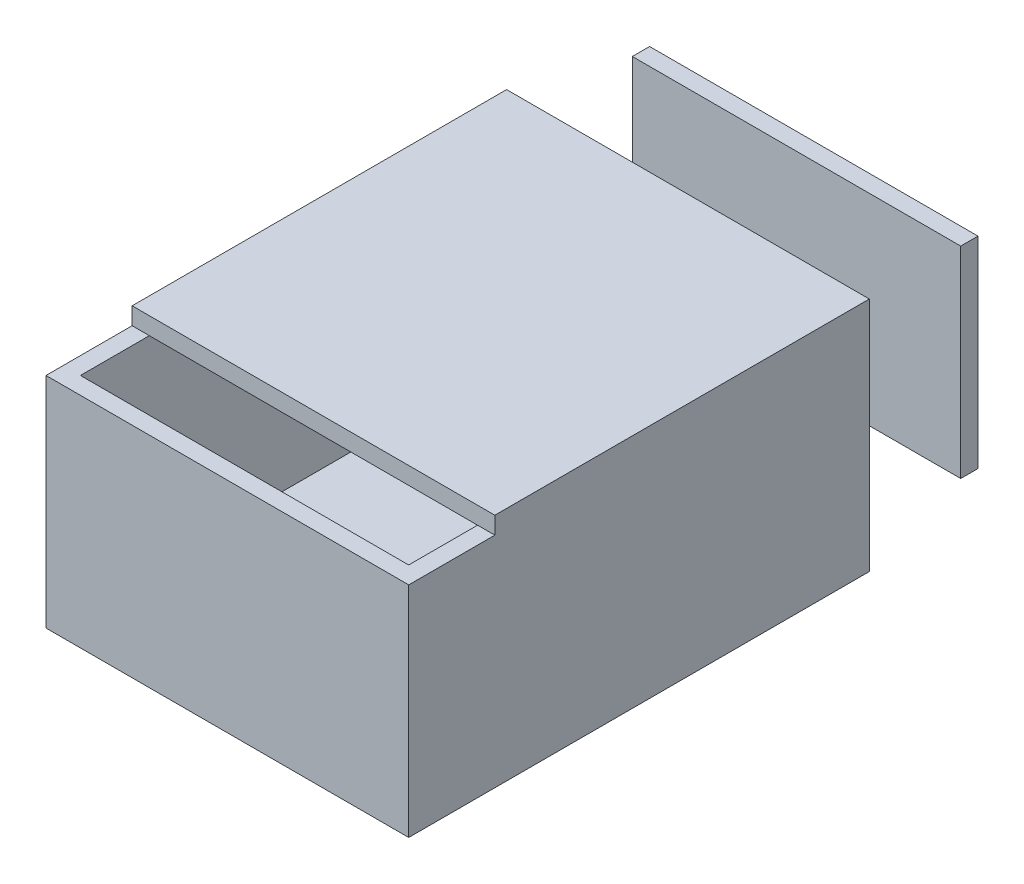
ISO-10303-21;
HEADER;
FILE_DESCRIPTION(('STEP AP214'),'2;1');
FILE_NAME('part.step','',(''),(''),'','','');
FILE_SCHEMA(('AUTOMOTIVE_DESIGN { 1 0 10303 214 1 1 1 1 }'));
ENDSEC;
DATA;
#1=APPLICATION_CONTEXT('core data for automotive mechanical design processes');
#2=APPLICATION_PROTOCOL_DEFINITION('international standard','automotive_design',2000,#1);
#3=PRODUCT_CONTEXT('',#1,'mechanical');
#4=PRODUCT('Part','Part','',(#3));
#5=PRODUCT_RELATED_PRODUCT_CATEGORY('part','',(#4));
#6=PRODUCT_DEFINITION_FORMATION('','',#4);
#7=PRODUCT_DEFINITION_CONTEXT('part definition',#1,'design');
#8=PRODUCT_DEFINITION('design','',#6,#7);
#9=PRODUCT_DEFINITION_SHAPE('','',#8);
#10=(LENGTH_UNIT() NAMED_UNIT(*) SI_UNIT(.MILLI.,.METRE.));
#11=(NAMED_UNIT(*) PLANE_ANGLE_UNIT() SI_UNIT($,.RADIAN.));
#12=(NAMED_UNIT(*) SI_UNIT($,.STERADIAN.) SOLID_ANGLE_UNIT());
#13=UNCERTAINTY_MEASURE_WITH_UNIT(LENGTH_MEASURE(1.E-05),#10,'distance_accuracy_value','');
#14=(GEOMETRIC_REPRESENTATION_CONTEXT(3) GLOBAL_UNCERTAINTY_ASSIGNED_CONTEXT((#13)) GLOBAL_UNIT_ASSIGNED_CONTEXT((#10,
#11,#12)) REPRESENTATION_CONTEXT('',''));
#15=CARTESIAN_POINT('',(0.,0.,0.));
#16=DIRECTION('',(0.,0.,1.));
#17=DIRECTION('',(1.,0.,0.));
#18=AXIS2_PLACEMENT_3D('',#15,#16,#17);
#19=CARTESIAN_POINT('',(1.83640845354915,36.8983163967638,-23.));
#20=DIRECTION('',(0.,-1.,0.));
#21=DIRECTION('',(0.,0.,-1.));
#22=AXIS2_PLACEMENT_3D('',#19,#20,#21);
#23=PLANE('',#22);
#24=DIRECTION('',(1.,0.,0.));
#25=VECTOR('',#24,1.);
#26=CARTESIAN_POINT('',(1.83640845354915,36.8983163967638,-20.));
#27=LINE('',#26,#25);
#28=CARTESIAN_POINT('',(1.83640845354915,36.8983163967638,-20.));
#29=VERTEX_POINT('',#28);
#30=CARTESIAN_POINT('',(58.8750360024886,36.8983163967638,-20.));
#31=VERTEX_POINT('',#30);
#32=EDGE_CURVE('E112',#29,#31,#27,.T.);
#33=ORIENTED_EDGE('',*,*,#32,.T.);
#34=DIRECTION('',(0.,0.,1.));
#35=VECTOR('',#34,1.);
#36=CARTESIAN_POINT('',(58.8750360024886,36.8983163967638,-23.));
#37=LINE('',#36,#35);
#38=CARTESIAN_POINT('',(58.8750360024886,36.8983163967638,-23.));
#39=VERTEX_POINT('',#38);
#40=EDGE_CURVE('E12',#39,#31,#37,.T.);
#41=ORIENTED_EDGE('',*,*,#40,.F.);
#42=DIRECTION('',(1.,0.,0.));
#43=VECTOR('',#42,1.);
#44=CARTESIAN_POINT('',(1.83640845354915,36.8983163967638,-23.));
#45=LINE('',#44,#43);
#46=CARTESIAN_POINT('',(1.83640845354915,36.8983163967638,-23.));
#47=VERTEX_POINT('',#46);
#48=EDGE_CURVE('E100',#47,#39,#45,.T.);
#49=ORIENTED_EDGE('',*,*,#48,.F.);
#50=DIRECTION('',(0.,0.,1.));
#51=VECTOR('',#50,1.);
#52=CARTESIAN_POINT('',(1.83640845354915,36.8983163967638,-23.));
#53=LINE('',#52,#51);
#54=EDGE_CURVE('E108',#47,#29,#53,.T.);
#55=ORIENTED_EDGE('',*,*,#54,.T.);
#56=EDGE_LOOP('',(#33,#41,#49,#55));
#57=FACE_BOUND('',#56,.T.);
#58=ADVANCED_FACE('F49',(#57),#23,.F.);
#59=CARTESIAN_POINT('',(58.8750360024886,36.8983163967638,-23.));
#60=DIRECTION('',(-1.,0.,0.));
#61=DIRECTION('',(0.,0.,1.));
#62=AXIS2_PLACEMENT_3D('',#59,#60,#61);
#63=PLANE('',#62);
#64=DIRECTION('',(0.,-1.,0.));
#65=VECTOR('',#64,1.);
#66=CARTESIAN_POINT('',(58.8750360024886,36.8983163967638,-20.));
#67=LINE('',#66,#65);
#68=CARTESIAN_POINT('',(58.8750360024886,1.9307687903769,-20.));
#69=VERTEX_POINT('',#68);
#70=EDGE_CURVE('E104',#31,#69,#67,.T.);
#71=ORIENTED_EDGE('',*,*,#70,.T.);
#72=DIRECTION('',(0.,0.,1.));
#73=VECTOR('',#72,1.);
#74=CARTESIAN_POINT('',(58.8750360024886,1.9307687903769,-23.));
#75=LINE('',#74,#73);
#76=CARTESIAN_POINT('',(58.8750360024886,1.9307687903769,-23.));
#77=VERTEX_POINT('',#76);
#78=EDGE_CURVE('E57',#77,#69,#75,.T.);
#79=ORIENTED_EDGE('',*,*,#78,.F.);
#80=DIRECTION('',(0.,-1.,0.));
#81=VECTOR('',#80,1.);
#82=CARTESIAN_POINT('',(58.8750360024886,36.8983163967638,-23.));
#83=LINE('',#82,#81);
#84=EDGE_CURVE('E95',#39,#77,#83,.T.);
#85=ORIENTED_EDGE('',*,*,#84,.F.);
#86=ORIENTED_EDGE('',*,*,#40,.T.);
#87=EDGE_LOOP('',(#71,#79,#85,#86));
#88=FACE_BOUND('',#87,.T.);
#89=ADVANCED_FACE('F103',(#88),#63,.F.);
#90=CARTESIAN_POINT('',(58.8750360024886,1.9307687903769,-23.));
#91=DIRECTION('',(0.,1.,0.));
#92=DIRECTION('',(0.,0.,1.));
#93=AXIS2_PLACEMENT_3D('',#90,#91,#92);
#94=PLANE('',#93);
#95=DIRECTION('',(-1.,0.,0.));
#96=VECTOR('',#95,1.);
#97=CARTESIAN_POINT('',(58.8750360024886,1.9307687903769,-20.));
#98=LINE('',#97,#96);
#99=CARTESIAN_POINT('',(1.83640845354915,1.9307687903769,-20.));
#100=VERTEX_POINT('',#99);
#101=EDGE_CURVE('E82',#69,#100,#98,.T.);
#102=ORIENTED_EDGE('',*,*,#101,.T.);
#103=DIRECTION('',(0.,0.,1.));
#104=VECTOR('',#103,1.);
#105=CARTESIAN_POINT('',(1.83640845354915,1.9307687903769,-23.));
#106=LINE('',#105,#104);
#107=CARTESIAN_POINT('',(1.83640845354915,1.9307687903769,-23.));
#108=VERTEX_POINT('',#107);
#109=EDGE_CURVE('E105',#108,#100,#106,.T.);
#110=ORIENTED_EDGE('',*,*,#109,.F.);
#111=DIRECTION('',(-1.,0.,0.));
#112=VECTOR('',#111,1.);
#113=CARTESIAN_POINT('',(58.8750360024886,1.9307687903769,-23.));
#114=LINE('',#113,#112);
#115=EDGE_CURVE('E98',#77,#108,#114,.T.);
#116=ORIENTED_EDGE('',*,*,#115,.F.);
#117=ORIENTED_EDGE('',*,*,#78,.T.);
#118=EDGE_LOOP('',(#102,#110,#116,#117));
#119=FACE_BOUND('',#118,.T.);
#120=ADVANCED_FACE('F106',(#119),#94,.F.);
#121=CARTESIAN_POINT('',(1.83640845354915,1.9307687903769,-23.));
#122=DIRECTION('',(1.,0.,0.));
#123=DIRECTION('',(0.,0.,-1.));
#124=AXIS2_PLACEMENT_3D('',#121,#122,#123);
#125=PLANE('',#124);
#126=DIRECTION('',(0.,1.,0.));
#127=VECTOR('',#126,1.);
#128=CARTESIAN_POINT('',(1.83640845354915,1.9307687903769,-20.));
#129=LINE('',#128,#127);
#130=EDGE_CURVE('E88',#100,#29,#129,.T.);
#131=ORIENTED_EDGE('',*,*,#130,.T.);
#132=ORIENTED_EDGE('',*,*,#54,.F.);
#133=DIRECTION('',(0.,1.,0.));
#134=VECTOR('',#133,1.);
#135=CARTESIAN_POINT('',(1.83640845354915,1.9307687903769,-23.));
#136=LINE('',#135,#134);
#137=EDGE_CURVE('E65',#108,#47,#136,.T.);
#138=ORIENTED_EDGE('',*,*,#137,.F.);
#139=ORIENTED_EDGE('',*,*,#109,.T.);
#140=EDGE_LOOP('',(#131,#132,#138,#139));
#141=FACE_BOUND('',#140,.T.);
#142=ADVANCED_FACE('F119',(#141),#125,.F.);
#143=CARTESIAN_POINT('',(0.,0.,-23.));
#144=DIRECTION('',(0.,0.,-1.));
#145=DIRECTION('',(-1.,0.,0.));
#146=AXIS2_PLACEMENT_3D('',#143,#144,#145);
#147=PLANE('',#146);
#148=ORIENTED_EDGE('',*,*,#48,.T.);
#149=ORIENTED_EDGE('',*,*,#84,.T.);
#150=ORIENTED_EDGE('',*,*,#115,.T.);
#151=ORIENTED_EDGE('',*,*,#137,.T.);
#152=EDGE_LOOP('',(#148,#149,#150,#151));
#153=FACE_BOUND('',#152,.T.);
#154=ADVANCED_FACE('F96',(#153),#147,.T.);
#155=CARTESIAN_POINT('',(0.,0.,-20.));
#156=DIRECTION('',(0.,0.,-1.));
#157=DIRECTION('',(-1.,0.,0.));
#158=AXIS2_PLACEMENT_3D('',#155,#156,#157);
#159=PLANE('',#158);
#160=ORIENTED_EDGE('',*,*,#32,.F.);
#161=ORIENTED_EDGE('',*,*,#130,.F.);
#162=ORIENTED_EDGE('',*,*,#101,.F.);
#163=ORIENTED_EDGE('',*,*,#70,.F.);
#164=EDGE_LOOP('',(#160,#161,#162,#163));
#165=FACE_BOUND('',#164,.T.);
#166=ADVANCED_FACE('F122',(#165),#159,.F.);
#167=CLOSED_SHELL('',(#58,#89,#120,#142,#154,#166));
#168=MANIFOLD_SOLID_BREP('B2',#167);
#169=CARTESIAN_POINT('',(0.,3.,0.));
#170=DIRECTION('',(0.,-1.,0.));
#171=DIRECTION('',(0.,0.,-1.));
#172=AXIS2_PLACEMENT_3D('',#169,#170,#171);
#173=PLANE('',#172);
#174=DIRECTION('',(0.,0.,-1.));
#175=VECTOR('',#174,1.);
#176=CARTESIAN_POINT('',(2.99035903033484,3.,77.0105584615521));
#177=LINE('',#176,#175);
#178=CARTESIAN_POINT('',(2.99035903033484,3.,77.0105584615521));
#179=VERTEX_POINT('',#178);
#180=CARTESIAN_POINT('',(2.99035903033484,3.,0.));
#181=VERTEX_POINT('',#180);
#182=EDGE_CURVE('E308',#179,#181,#177,.T.);
#183=ORIENTED_EDGE('',*,*,#182,.F.);
#184=DIRECTION('',(-1.,0.,0.));
#185=VECTOR('',#184,1.);
#186=CARTESIAN_POINT('',(60.0017062927378,3.,77.0105584615521));
#187=LINE('',#186,#185);
#188=CARTESIAN_POINT('',(60.0017062927378,3.,77.0105584615521));
#189=VERTEX_POINT('',#188);
#190=EDGE_CURVE('E330',#189,#179,#187,.T.);
#191=ORIENTED_EDGE('',*,*,#190,.F.);
#192=DIRECTION('',(0.,0.,1.));
#193=VECTOR('',#192,1.);
#194=CARTESIAN_POINT('',(60.0017062927378,3.,0.));
#195=LINE('',#194,#193);
#196=CARTESIAN_POINT('',(60.0017062927378,3.,0.));
#197=VERTEX_POINT('',#196);
#198=EDGE_CURVE('E302',#197,#189,#195,.T.);
#199=ORIENTED_EDGE('',*,*,#198,.F.);
#200=DIRECTION('',(-1.,0.,0.));
#201=VECTOR('',#200,1.);
#202=CARTESIAN_POINT('',(0.,3.,0.));
#203=LINE('',#202,#201);
#204=EDGE_CURVE('E269',#197,#181,#203,.T.);
#205=ORIENTED_EDGE('',*,*,#204,.T.);
#206=EDGE_LOOP('',(#183,#191,#199,#205));
#207=FACE_BOUND('',#206,.T.);
#208=ADVANCED_FACE('F173',(#207),#173,.F.);
#209=CARTESIAN_POINT('',(0.,3.,80.));
#210=DIRECTION('',(1.,0.,0.));
#211=DIRECTION('',(0.,0.,-1.));
#212=AXIS2_PLACEMENT_3D('',#209,#210,#211);
#213=PLANE('',#212);
#214=DIRECTION('',(0.,0.,1.));
#215=VECTOR('',#214,1.);
#216=CARTESIAN_POINT('',(0.,0.,80.));
#217=LINE('',#216,#215);
#218=CARTESIAN_POINT('',(0.,0.,0.));
#219=VERTEX_POINT('',#218);
#220=CARTESIAN_POINT('',(0.,0.,80.));
#221=VERTEX_POINT('',#220);
#222=EDGE_CURVE('E352',#219,#221,#217,.T.);
#223=ORIENTED_EDGE('',*,*,#222,.T.);
#224=DIRECTION('',(0.,-1.,0.));
#225=VECTOR('',#224,1.);
#226=CARTESIAN_POINT('',(0.,3.,80.));
#227=LINE('',#226,#225);
#228=CARTESIAN_POINT('',(0.,38.,80.));
#229=VERTEX_POINT('',#228);
#230=EDGE_CURVE('E177',#229,#221,#227,.T.);
#231=ORIENTED_EDGE('',*,*,#230,.F.);
#232=DIRECTION('',(0.,0.,1.));
#233=VECTOR('',#232,1.);
#234=CARTESIAN_POINT('',(0.,38.,0.));
#235=LINE('',#234,#233);
#236=CARTESIAN_POINT('',(0.,38.,65.0418472472438));
#237=VERTEX_POINT('',#236);
#238=EDGE_CURVE('E323',#237,#229,#235,.T.);
#239=ORIENTED_EDGE('',*,*,#238,.F.);
#240=DIRECTION('',(0.,-1.,0.));
#241=VECTOR('',#240,1.);
#242=CARTESIAN_POINT('',(0.,41.,65.0418472472438));
#243=LINE('',#242,#241);
#244=CARTESIAN_POINT('',(0.,41.,65.0418472472438));
#245=VERTEX_POINT('',#244);
#246=EDGE_CURVE('E274',#245,#237,#243,.T.);
#247=ORIENTED_EDGE('',*,*,#246,.F.);
#248=DIRECTION('',(0.,0.,1.));
#249=VECTOR('',#248,1.);
#250=CARTESIAN_POINT('',(0.,41.,65.0418472472438));
#251=LINE('',#250,#249);
#252=CARTESIAN_POINT('',(0.,41.,0.));
#253=VERTEX_POINT('',#252);
#254=EDGE_CURVE('E272',#253,#245,#251,.T.);
#255=ORIENTED_EDGE('',*,*,#254,.F.);
#256=DIRECTION('',(0.,-1.,0.));
#257=VECTOR('',#256,1.);
#258=CARTESIAN_POINT('',(0.,3.,0.));
#259=LINE('',#258,#257);
#260=EDGE_CURVE('E256',#253,#219,#259,.T.);
#261=ORIENTED_EDGE('',*,*,#260,.T.);
#262=EDGE_LOOP('',(#223,#231,#239,#247,#255,#261));
#263=FACE_BOUND('',#262,.T.);
#264=ADVANCED_FACE('F175',(#263),#213,.F.);
#265=CARTESIAN_POINT('',(63.,3.,80.));
#266=DIRECTION('',(0.,0.,-1.));
#267=DIRECTION('',(-1.,0.,0.));
#268=AXIS2_PLACEMENT_3D('',#265,#266,#267);
#269=PLANE('',#268);
#270=DIRECTION('',(1.,0.,0.));
#271=VECTOR('',#270,1.);
#272=CARTESIAN_POINT('',(63.,0.,80.));
#273=LINE('',#272,#271);
#274=CARTESIAN_POINT('',(63.,0.,80.));
#275=VERTEX_POINT('',#274);
#276=EDGE_CURVE('E357',#221,#275,#273,.T.);
#277=ORIENTED_EDGE('',*,*,#276,.T.);
#278=DIRECTION('',(0.,-1.,0.));
#279=VECTOR('',#278,1.);
#280=CARTESIAN_POINT('',(63.,3.,80.));
#281=LINE('',#280,#279);
#282=CARTESIAN_POINT('',(63.,38.,80.));
#283=VERTEX_POINT('',#282);
#284=EDGE_CURVE('E366',#283,#275,#281,.T.);
#285=ORIENTED_EDGE('',*,*,#284,.F.);
#286=DIRECTION('',(1.,0.,0.));
#287=VECTOR('',#286,1.);
#288=CARTESIAN_POINT('',(0.,38.,80.));
#289=LINE('',#288,#287);
#290=EDGE_CURVE('E303',#229,#283,#289,.T.);
#291=ORIENTED_EDGE('',*,*,#290,.F.);
#292=ORIENTED_EDGE('',*,*,#230,.T.);
#293=EDGE_LOOP('',(#277,#285,#291,#292));
#294=FACE_BOUND('',#293,.T.);
#295=ADVANCED_FACE('F377',(#294),#269,.F.);
#296=CARTESIAN_POINT('',(63.,3.,0.));
#297=DIRECTION('',(-1.,0.,0.));
#298=DIRECTION('',(0.,0.,1.));
#299=AXIS2_PLACEMENT_3D('',#296,#297,#298);
#300=PLANE('',#299);
#301=DIRECTION('',(0.,0.,-1.));
#302=VECTOR('',#301,1.);
#303=CARTESIAN_POINT('',(63.,0.,0.));
#304=LINE('',#303,#302);
#305=CARTESIAN_POINT('',(63.,0.,0.));
#306=VERTEX_POINT('',#305);
#307=EDGE_CURVE('E360',#275,#306,#304,.T.);
#308=ORIENTED_EDGE('',*,*,#307,.T.);
#309=DIRECTION('',(0.,-1.,0.));
#310=VECTOR('',#309,1.);
#311=CARTESIAN_POINT('',(63.,3.,0.));
#312=LINE('',#311,#310);
#313=CARTESIAN_POINT('',(63.,41.,0.));
#314=VERTEX_POINT('',#313);
#315=EDGE_CURVE('E268',#314,#306,#312,.T.);
#316=ORIENTED_EDGE('',*,*,#315,.F.);
#317=DIRECTION('',(0.,0.,-1.));
#318=VECTOR('',#317,1.);
#319=CARTESIAN_POINT('',(63.,41.,0.));
#320=LINE('',#319,#318);
#321=CARTESIAN_POINT('',(63.,41.,65.0418472472438));
#322=VERTEX_POINT('',#321);
#323=EDGE_CURVE('E283',#322,#314,#320,.T.);
#324=ORIENTED_EDGE('',*,*,#323,.F.);
#325=DIRECTION('',(0.,-1.,0.));
#326=VECTOR('',#325,1.);
#327=CARTESIAN_POINT('',(63.,41.,65.0418472472438));
#328=LINE('',#327,#326);
#329=CARTESIAN_POINT('',(63.,38.,65.0418472472438));
#330=VERTEX_POINT('',#329);
#331=EDGE_CURVE('E292',#322,#330,#328,.T.);
#332=ORIENTED_EDGE('',*,*,#331,.T.);
#333=DIRECTION('',(0.,0.,-1.));
#334=VECTOR('',#333,1.);
#335=CARTESIAN_POINT('',(63.,38.,80.));
#336=LINE('',#335,#334);
#337=EDGE_CURVE('E307',#283,#330,#336,.T.);
#338=ORIENTED_EDGE('',*,*,#337,.F.);
#339=ORIENTED_EDGE('',*,*,#284,.T.);
#340=EDGE_LOOP('',(#308,#316,#324,#332,#338,#339));
#341=FACE_BOUND('',#340,.T.);
#342=ADVANCED_FACE('F380',(#341),#300,.F.);
#343=CARTESIAN_POINT('',(0.,3.,0.));
#344=DIRECTION('',(0.,0.,1.));
#345=DIRECTION('',(1.,0.,0.));
#346=AXIS2_PLACEMENT_3D('',#343,#344,#345);
#347=PLANE('',#346);
#348=DIRECTION('',(0.,-1.,0.));
#349=VECTOR('',#348,1.);
#350=CARTESIAN_POINT('',(60.0017062927378,38.,0.));
#351=LINE('',#350,#349);
#352=CARTESIAN_POINT('',(60.0017062927378,38.,0.));
#353=VERTEX_POINT('',#352);
#354=EDGE_CURVE('E348',#353,#197,#351,.T.);
#355=ORIENTED_EDGE('',*,*,#354,.F.);
#356=DIRECTION('',(-1.,0.,0.));
#357=VECTOR('',#356,1.);
#358=CARTESIAN_POINT('',(0.,38.,0.));
#359=LINE('',#358,#357);
#360=CARTESIAN_POINT('',(2.99035903033484,38.,0.));
#361=VERTEX_POINT('',#360);
#362=EDGE_CURVE('E293',#353,#361,#359,.T.);
#363=ORIENTED_EDGE('',*,*,#362,.T.);
#364=DIRECTION('',(0.,-1.,0.));
#365=VECTOR('',#364,1.);
#366=CARTESIAN_POINT('',(2.99035903033484,38.,0.));
#367=LINE('',#366,#365);
#368=EDGE_CURVE('E326',#361,#181,#367,.T.);
#369=ORIENTED_EDGE('',*,*,#368,.T.);
#370=ORIENTED_EDGE('',*,*,#204,.F.);
#371=EDGE_LOOP('',(#355,#363,#369,#370));
#372=FACE_BOUND('',#371,.T.);
#373=DIRECTION('',(-1.,0.,0.));
#374=VECTOR('',#373,1.);
#375=CARTESIAN_POINT('',(0.,0.,0.));
#376=LINE('',#375,#374);
#377=EDGE_CURVE('E263',#306,#219,#376,.T.);
#378=ORIENTED_EDGE('',*,*,#377,.T.);
#379=ORIENTED_EDGE('',*,*,#260,.F.);
#380=DIRECTION('',(-1.,0.,0.));
#381=VECTOR('',#380,1.);
#382=CARTESIAN_POINT('',(0.,41.,0.));
#383=LINE('',#382,#381);
#384=EDGE_CURVE('E261',#314,#253,#383,.T.);
#385=ORIENTED_EDGE('',*,*,#384,.F.);
#386=ORIENTED_EDGE('',*,*,#315,.T.);
#387=EDGE_LOOP('',(#378,#379,#385,#386));
#388=FACE_BOUND('',#387,.T.);
#389=ADVANCED_FACE('F258',(#372,#388),#347,.F.);
#390=CARTESIAN_POINT('',(0.,0.,0.));
#391=DIRECTION('',(0.,-1.,0.));
#392=DIRECTION('',(0.,0.,-1.));
#393=AXIS2_PLACEMENT_3D('',#390,#391,#392);
#394=PLANE('',#393);
#395=ORIENTED_EDGE('',*,*,#222,.F.);
#396=ORIENTED_EDGE('',*,*,#377,.F.);
#397=ORIENTED_EDGE('',*,*,#307,.F.);
#398=ORIENTED_EDGE('',*,*,#276,.F.);
#399=EDGE_LOOP('',(#395,#396,#397,#398));
#400=FACE_BOUND('',#399,.T.);
#401=ADVANCED_FACE('F379',(#400),#394,.T.);
#402=CARTESIAN_POINT('',(60.0017062927378,38.,0.));
#403=DIRECTION('',(1.,0.,0.));
#404=DIRECTION('',(0.,0.,-1.));
#405=AXIS2_PLACEMENT_3D('',#402,#403,#404);
#406=PLANE('',#405);
#407=ORIENTED_EDGE('',*,*,#198,.T.);
#408=DIRECTION('',(0.,-1.,0.));
#409=VECTOR('',#408,1.);
#410=CARTESIAN_POINT('',(60.0017062927378,38.,77.0105584615521));
#411=LINE('',#410,#409);
#412=CARTESIAN_POINT('',(60.0017062927378,38.,77.0105584615521));
#413=VERTEX_POINT('',#412);
#414=EDGE_CURVE('E344',#413,#189,#411,.T.);
#415=ORIENTED_EDGE('',*,*,#414,.F.);
#416=DIRECTION('',(0.,0.,1.));
#417=VECTOR('',#416,1.);
#418=CARTESIAN_POINT('',(60.0017062927378,38.,0.));
#419=LINE('',#418,#417);
#420=CARTESIAN_POINT('',(60.0017062927378,38.,65.0418472472438));
#421=VERTEX_POINT('',#420);
#422=EDGE_CURVE('E311',#421,#413,#419,.T.);
#423=ORIENTED_EDGE('',*,*,#422,.F.);
#424=EDGE_CURVE('E312',#353,#421,#419,.T.);
#425=ORIENTED_EDGE('',*,*,#424,.F.);
#426=ORIENTED_EDGE('',*,*,#354,.T.);
#427=EDGE_LOOP('',(#407,#415,#423,#425,#426));
#428=FACE_BOUND('',#427,.T.);
#429=ADVANCED_FACE('F394',(#428),#406,.F.);
#430=CARTESIAN_POINT('',(60.0017062927378,38.,77.0105584615521));
#431=DIRECTION('',(0.,0.,1.));
#432=DIRECTION('',(1.,0.,0.));
#433=AXIS2_PLACEMENT_3D('',#430,#431,#432);
#434=PLANE('',#433);
#435=ORIENTED_EDGE('',*,*,#190,.T.);
#436=DIRECTION('',(0.,-1.,0.));
#437=VECTOR('',#436,1.);
#438=CARTESIAN_POINT('',(2.99035903033484,38.,77.0105584615521));
#439=LINE('',#438,#437);
#440=CARTESIAN_POINT('',(2.99035903033484,38.,77.0105584615521));
#441=VERTEX_POINT('',#440);
#442=EDGE_CURVE('E340',#441,#179,#439,.T.);
#443=ORIENTED_EDGE('',*,*,#442,.F.);
#444=DIRECTION('',(-1.,0.,0.));
#445=VECTOR('',#444,1.);
#446=CARTESIAN_POINT('',(60.0017062927378,38.,77.0105584615521));
#447=LINE('',#446,#445);
#448=EDGE_CURVE('E316',#413,#441,#447,.T.);
#449=ORIENTED_EDGE('',*,*,#448,.F.);
#450=ORIENTED_EDGE('',*,*,#414,.T.);
#451=EDGE_LOOP('',(#435,#443,#449,#450));
#452=FACE_BOUND('',#451,.T.);
#453=ADVANCED_FACE('F403',(#452),#434,.F.);
#454=CARTESIAN_POINT('',(2.99035903033484,38.,77.0105584615521));
#455=DIRECTION('',(-1.,0.,0.));
#456=DIRECTION('',(0.,0.,1.));
#457=AXIS2_PLACEMENT_3D('',#454,#455,#456);
#458=PLANE('',#457);
#459=ORIENTED_EDGE('',*,*,#182,.T.);
#460=ORIENTED_EDGE('',*,*,#368,.F.);
#461=DIRECTION('',(0.,0.,-1.));
#462=VECTOR('',#461,1.);
#463=CARTESIAN_POINT('',(2.99035903033484,38.,77.0105584615521));
#464=LINE('',#463,#462);
#465=CARTESIAN_POINT('',(2.99035903033484,38.,65.0418472472438));
#466=VERTEX_POINT('',#465);
#467=EDGE_CURVE('E319',#466,#361,#464,.T.);
#468=ORIENTED_EDGE('',*,*,#467,.F.);
#469=EDGE_CURVE('E320',#441,#466,#464,.T.);
#470=ORIENTED_EDGE('',*,*,#469,.F.);
#471=ORIENTED_EDGE('',*,*,#442,.T.);
#472=EDGE_LOOP('',(#459,#460,#468,#470,#471));
#473=FACE_BOUND('',#472,.T.);
#474=ADVANCED_FACE('F405',(#473),#458,.F.);
#475=CARTESIAN_POINT('',(0.,38.,0.));
#476=DIRECTION('',(0.,1.,0.));
#477=DIRECTION('',(0.,0.,1.));
#478=AXIS2_PLACEMENT_3D('',#475,#476,#477);
#479=PLANE('',#478);
#480=DIRECTION('',(1.,0.,0.));
#481=VECTOR('',#480,1.);
#482=CARTESIAN_POINT('',(63.,38.,65.0418472472438));
#483=LINE('',#482,#481);
#484=EDGE_CURVE('E184',#237,#466,#483,.T.);
#485=ORIENTED_EDGE('',*,*,#484,.F.);
#486=ORIENTED_EDGE('',*,*,#238,.T.);
#487=ORIENTED_EDGE('',*,*,#290,.T.);
#488=ORIENTED_EDGE('',*,*,#337,.T.);
#489=EDGE_CURVE('E47',#421,#330,#483,.T.);
#490=ORIENTED_EDGE('',*,*,#489,.F.);
#491=ORIENTED_EDGE('',*,*,#422,.T.);
#492=ORIENTED_EDGE('',*,*,#448,.T.);
#493=ORIENTED_EDGE('',*,*,#469,.T.);
#494=EDGE_LOOP('',(#485,#486,#487,#488,#490,#491,#492,#493));
#495=FACE_BOUND('',#494,.T.);
#496=ADVANCED_FACE('F399',(#495),#479,.T.);
#497=CARTESIAN_POINT('',(63.,41.,65.0418472472438));
#498=DIRECTION('',(0.,0.,-1.));
#499=DIRECTION('',(-1.,0.,0.));
#500=AXIS2_PLACEMENT_3D('',#497,#498,#499);
#501=PLANE('',#500);
#502=ORIENTED_EDGE('',*,*,#484,.T.);
#503=EDGE_CURVE('E185',#466,#421,#483,.T.);
#504=ORIENTED_EDGE('',*,*,#503,.T.);
#505=ORIENTED_EDGE('',*,*,#489,.T.);
#506=ORIENTED_EDGE('',*,*,#331,.F.);
#507=DIRECTION('',(1.,0.,0.));
#508=VECTOR('',#507,1.);
#509=CARTESIAN_POINT('',(63.,41.,65.0418472472438));
#510=LINE('',#509,#508);
#511=EDGE_CURVE('E278',#245,#322,#510,.T.);
#512=ORIENTED_EDGE('',*,*,#511,.F.);
#513=ORIENTED_EDGE('',*,*,#246,.T.);
#514=EDGE_LOOP('',(#502,#504,#505,#506,#512,#513));
#515=FACE_BOUND('',#514,.T.);
#516=ADVANCED_FACE('F383',(#515),#501,.F.);
#517=CARTESIAN_POINT('',(0.,41.,0.));
#518=DIRECTION('',(0.,-1.,0.));
#519=DIRECTION('',(0.,0.,-1.));
#520=AXIS2_PLACEMENT_3D('',#517,#518,#519);
#521=PLANE('',#520);
#522=ORIENTED_EDGE('',*,*,#384,.T.);
#523=ORIENTED_EDGE('',*,*,#254,.T.);
#524=ORIENTED_EDGE('',*,*,#511,.T.);
#525=ORIENTED_EDGE('',*,*,#323,.T.);
#526=EDGE_LOOP('',(#522,#523,#524,#525));
#527=FACE_BOUND('',#526,.T.);
#528=ADVANCED_FACE('F281',(#527),#521,.F.);
#529=CARTESIAN_POINT('',(0.,38.,0.));
#530=DIRECTION('',(0.,-1.,0.));
#531=DIRECTION('',(0.,0.,-1.));
#532=AXIS2_PLACEMENT_3D('',#529,#530,#531);
#533=PLANE('',#532);
#534=ORIENTED_EDGE('',*,*,#362,.F.);
#535=ORIENTED_EDGE('',*,*,#424,.T.);
#536=ORIENTED_EDGE('',*,*,#503,.F.);
#537=ORIENTED_EDGE('',*,*,#467,.T.);
#538=EDGE_LOOP('',(#534,#535,#536,#537));
#539=FACE_BOUND('',#538,.T.);
#540=ADVANCED_FACE('F390',(#539),#533,.T.);
#541=CLOSED_SHELL('',(#208,#264,#295,#342,#389,#401,#429,#453,#474,#496,#516,#528,#540));
#542=MANIFOLD_SOLID_BREP('B6',#541);
#543=ADVANCED_BREP_SHAPE_REPRESENTATION('',(#18,#168,#542),#14);
#544=SHAPE_DEFINITION_REPRESENTATION(#9,#543);
ENDSEC;
END-ISO-10303-21;
